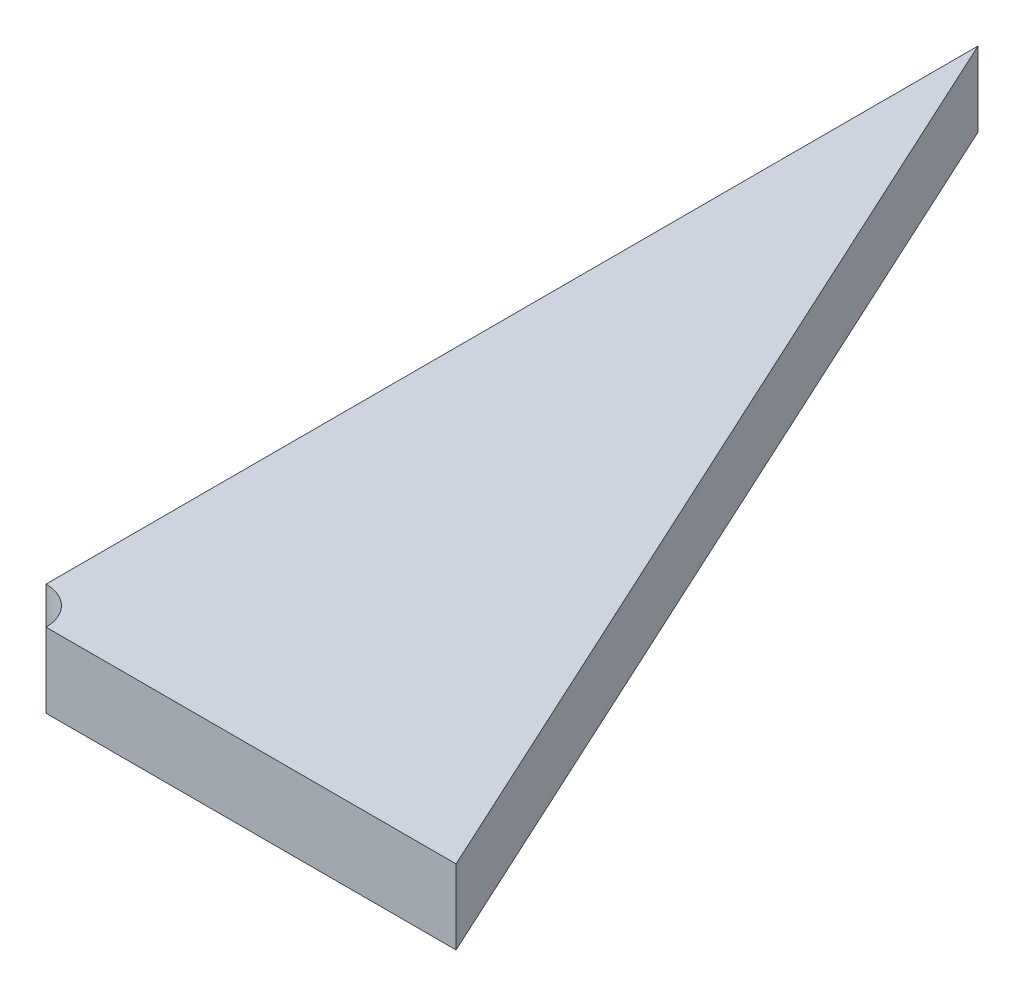
ISO-10303-21;
HEADER;
FILE_DESCRIPTION(('STEP AP214'),'2;1');
FILE_NAME('part.step','',(''),(''),'','','');
FILE_SCHEMA(('AUTOMOTIVE_DESIGN { 1 0 10303 214 1 1 1 1 }'));
ENDSEC;
DATA;
#1=APPLICATION_CONTEXT('core data for automotive mechanical design processes');
#2=APPLICATION_PROTOCOL_DEFINITION('international standard','automotive_design',2000,#1);
#3=PRODUCT_CONTEXT('',#1,'mechanical');
#4=PRODUCT('Part','Part','',(#3));
#5=PRODUCT_RELATED_PRODUCT_CATEGORY('part','',(#4));
#6=PRODUCT_DEFINITION_FORMATION('','',#4);
#7=PRODUCT_DEFINITION_CONTEXT('part definition',#1,'design');
#8=PRODUCT_DEFINITION('design','',#6,#7);
#9=PRODUCT_DEFINITION_SHAPE('','',#8);
#10=(LENGTH_UNIT() NAMED_UNIT(*) SI_UNIT(.MILLI.,.METRE.));
#11=(NAMED_UNIT(*) PLANE_ANGLE_UNIT() SI_UNIT($,.RADIAN.));
#12=(NAMED_UNIT(*) SI_UNIT($,.STERADIAN.) SOLID_ANGLE_UNIT());
#13=UNCERTAINTY_MEASURE_WITH_UNIT(LENGTH_MEASURE(1.E-05),#10,'distance_accuracy_value','');
#14=(GEOMETRIC_REPRESENTATION_CONTEXT(3) GLOBAL_UNCERTAINTY_ASSIGNED_CONTEXT((#13)) GLOBAL_UNIT_ASSIGNED_CONTEXT((#10,
#11,#12)) REPRESENTATION_CONTEXT('',''));
#15=CARTESIAN_POINT('',(0.,0.,0.));
#16=DIRECTION('',(0.,0.,1.));
#17=DIRECTION('',(1.,0.,0.));
#18=AXIS2_PLACEMENT_3D('',#15,#16,#17);
#19=CARTESIAN_POINT('',(0.,6.35,-165.1));
#20=DIRECTION('',(1.,0.,0.));
#21=DIRECTION('',(0.,0.,-1.));
#22=AXIS2_PLACEMENT_3D('',#19,#20,#21);
#23=PLANE('',#22);
#24=DIRECTION('',(0.,0.,1.));
#25=VECTOR('',#24,1.);
#26=CARTESIAN_POINT('',(0.,-6.35,-165.1));
#27=LINE('',#26,#25);
#28=CARTESIAN_POINT('',(0.,-6.35,-165.1));
#29=VERTEX_POINT('',#28);
#30=CARTESIAN_POINT('',(0.,-6.35,-6.35));
#31=VERTEX_POINT('',#30);
#32=EDGE_CURVE('E81',#29,#31,#27,.T.);
#33=ORIENTED_EDGE('',*,*,#32,.T.);
#34=DIRECTION('',(0.,1.,0.));
#35=VECTOR('',#34,1.);
#36=CARTESIAN_POINT('',(0.,-6.351,-6.35));
#37=LINE('',#36,#35);
#38=CARTESIAN_POINT('',(0.,6.35,-6.35));
#39=VERTEX_POINT('',#38);
#40=EDGE_CURVE('E47',#39,#31,#37,.F.);
#41=ORIENTED_EDGE('',*,*,#40,.F.);
#42=DIRECTION('',(0.,0.,1.));
#43=VECTOR('',#42,1.);
#44=CARTESIAN_POINT('',(0.,6.35,-165.1));
#45=LINE('',#44,#43);
#46=CARTESIAN_POINT('',(0.,6.35,-165.1));
#47=VERTEX_POINT('',#46);
#48=EDGE_CURVE('E76',#47,#39,#45,.T.);
#49=ORIENTED_EDGE('',*,*,#48,.F.);
#50=DIRECTION('',(0.,-1.,0.));
#51=VECTOR('',#50,1.);
#52=CARTESIAN_POINT('',(0.,6.35,-165.1));
#53=LINE('',#52,#51);
#54=EDGE_CURVE('E40',#47,#29,#53,.T.);
#55=ORIENTED_EDGE('',*,*,#54,.T.);
#56=EDGE_LOOP('',(#33,#41,#49,#55));
#57=FACE_BOUND('',#56,.T.);
#58=ADVANCED_FACE('F33',(#57),#23,.F.);
#59=CARTESIAN_POINT('',(0.,6.35,0.));
#60=DIRECTION('',(0.,0.,-1.));
#61=DIRECTION('',(-1.,0.,0.));
#62=AXIS2_PLACEMENT_3D('',#59,#60,#61);
#63=PLANE('',#62);
#64=DIRECTION('',(1.,0.,0.));
#65=VECTOR('',#64,1.);
#66=CARTESIAN_POINT('',(0.,6.35,0.));
#67=LINE('',#66,#65);
#68=CARTESIAN_POINT('',(6.35,6.35,0.));
#69=VERTEX_POINT('',#68);
#70=CARTESIAN_POINT('',(76.2,6.35,0.));
#71=VERTEX_POINT('',#70);
#72=EDGE_CURVE('E90',#69,#71,#67,.T.);
#73=ORIENTED_EDGE('',*,*,#72,.F.);
#74=DIRECTION('',(0.,1.,0.));
#75=VECTOR('',#74,1.);
#76=CARTESIAN_POINT('',(6.35,-6.351,0.));
#77=LINE('',#76,#75);
#78=CARTESIAN_POINT('',(6.35,-6.35,0.));
#79=VERTEX_POINT('',#78);
#80=EDGE_CURVE('E95',#79,#69,#77,.T.);
#81=ORIENTED_EDGE('',*,*,#80,.F.);
#82=DIRECTION('',(1.,0.,0.));
#83=VECTOR('',#82,1.);
#84=CARTESIAN_POINT('',(0.,-6.35,0.));
#85=LINE('',#84,#83);
#86=CARTESIAN_POINT('',(76.2,-6.35,0.));
#87=VERTEX_POINT('',#86);
#88=EDGE_CURVE('E77',#79,#87,#85,.T.);
#89=ORIENTED_EDGE('',*,*,#88,.T.);
#90=DIRECTION('',(0.,-1.,0.));
#91=VECTOR('',#90,1.);
#92=CARTESIAN_POINT('',(76.2,6.35,0.));
#93=LINE('',#92,#91);
#94=EDGE_CURVE('E11',#71,#87,#93,.T.);
#95=ORIENTED_EDGE('',*,*,#94,.F.);
#96=EDGE_LOOP('',(#73,#81,#89,#95));
#97=FACE_BOUND('',#96,.T.);
#98=ADVANCED_FACE('F106',(#97),#63,.F.);
#99=CARTESIAN_POINT('',(76.2,6.35,0.));
#100=DIRECTION('',(-0.907959384500452,0.,0.419058177461747));
#101=DIRECTION('',(0.419058177461747,0.,0.907959384500452));
#102=AXIS2_PLACEMENT_3D('',#99,#100,#101);
#103=PLANE('',#102);
#104=DIRECTION('',(-0.419058177461747,0.,-0.907959384500451));
#105=VECTOR('',#104,1.);
#106=CARTESIAN_POINT('',(76.2,-6.35,0.));
#107=LINE('',#106,#105);
#108=EDGE_CURVE('E68',#87,#29,#107,.T.);
#109=ORIENTED_EDGE('',*,*,#108,.T.);
#110=ORIENTED_EDGE('',*,*,#54,.F.);
#111=DIRECTION('',(-0.419058177461747,0.,-0.907959384500451));
#112=VECTOR('',#111,1.);
#113=CARTESIAN_POINT('',(76.2,6.35,0.));
#114=LINE('',#113,#112);
#115=EDGE_CURVE('E56',#71,#47,#114,.T.);
#116=ORIENTED_EDGE('',*,*,#115,.F.);
#117=ORIENTED_EDGE('',*,*,#94,.T.);
#118=EDGE_LOOP('',(#109,#110,#116,#117));
#119=FACE_BOUND('',#118,.T.);
#120=ADVANCED_FACE('F70',(#119),#103,.F.);
#121=CARTESIAN_POINT('',(0.,6.35,0.));
#122=DIRECTION('',(0.,1.,0.));
#123=DIRECTION('',(0.,0.,1.));
#124=AXIS2_PLACEMENT_3D('',#121,#122,#123);
#125=PLANE('',#124);
#126=CARTESIAN_POINT('',(0.,6.35,0.));
#127=DIRECTION('',(0.,1.,0.));
#128=DIRECTION('',(0.,0.,1.));
#129=AXIS2_PLACEMENT_3D('',#126,#127,#128);
#130=CIRCLE('',#129,6.35);
#131=EDGE_CURVE('E86',#69,#39,#130,.T.);
#132=ORIENTED_EDGE('',*,*,#131,.F.);
#133=ORIENTED_EDGE('',*,*,#72,.T.);
#134=ORIENTED_EDGE('',*,*,#115,.T.);
#135=ORIENTED_EDGE('',*,*,#48,.T.);
#136=EDGE_LOOP('',(#132,#133,#134,#135));
#137=FACE_BOUND('',#136,.T.);
#138=ADVANCED_FACE('F105',(#137),#125,.T.);
#139=CARTESIAN_POINT('',(0.,-6.35,0.));
#140=DIRECTION('',(0.,1.,0.));
#141=DIRECTION('',(0.,0.,1.));
#142=AXIS2_PLACEMENT_3D('',#139,#140,#141);
#143=PLANE('',#142);
#144=ORIENTED_EDGE('',*,*,#88,.F.);
#145=CARTESIAN_POINT('',(0.,-6.35,0.));
#146=DIRECTION('',(0.,1.,0.));
#147=DIRECTION('',(0.,0.,1.));
#148=AXIS2_PLACEMENT_3D('',#145,#146,#147);
#149=CIRCLE('',#148,6.35);
#150=EDGE_CURVE('E83',#31,#79,#149,.F.);
#151=ORIENTED_EDGE('',*,*,#150,.F.);
#152=ORIENTED_EDGE('',*,*,#32,.F.);
#153=ORIENTED_EDGE('',*,*,#108,.F.);
#154=EDGE_LOOP('',(#144,#151,#152,#153));
#155=FACE_BOUND('',#154,.T.);
#156=ADVANCED_FACE('F82',(#155),#143,.F.);
#157=CARTESIAN_POINT('',(0.,-6.351,0.));
#158=DIRECTION('',(0.,1.,0.));
#159=DIRECTION('',(0.,0.,1.));
#160=AXIS2_PLACEMENT_3D('',#157,#158,#159);
#161=CYLINDRICAL_SURFACE('',#160,6.35);
#162=ORIENTED_EDGE('',*,*,#40,.T.);
#163=ORIENTED_EDGE('',*,*,#150,.T.);
#164=ORIENTED_EDGE('',*,*,#80,.T.);
#165=ORIENTED_EDGE('',*,*,#131,.T.);
#166=EDGE_LOOP('',(#162,#163,#164,#165));
#167=FACE_BOUND('',#166,.T.);
#168=ADVANCED_FACE('F100',(#167),#161,.F.);
#169=CLOSED_SHELL('',(#58,#98,#120,#138,#156,#168));
#170=MANIFOLD_SOLID_BREP('B2',#169);
#171=ADVANCED_BREP_SHAPE_REPRESENTATION('',(#18,#170),#14);
#172=SHAPE_DEFINITION_REPRESENTATION(#9,#171);
ENDSEC;
END-ISO-10303-21;
